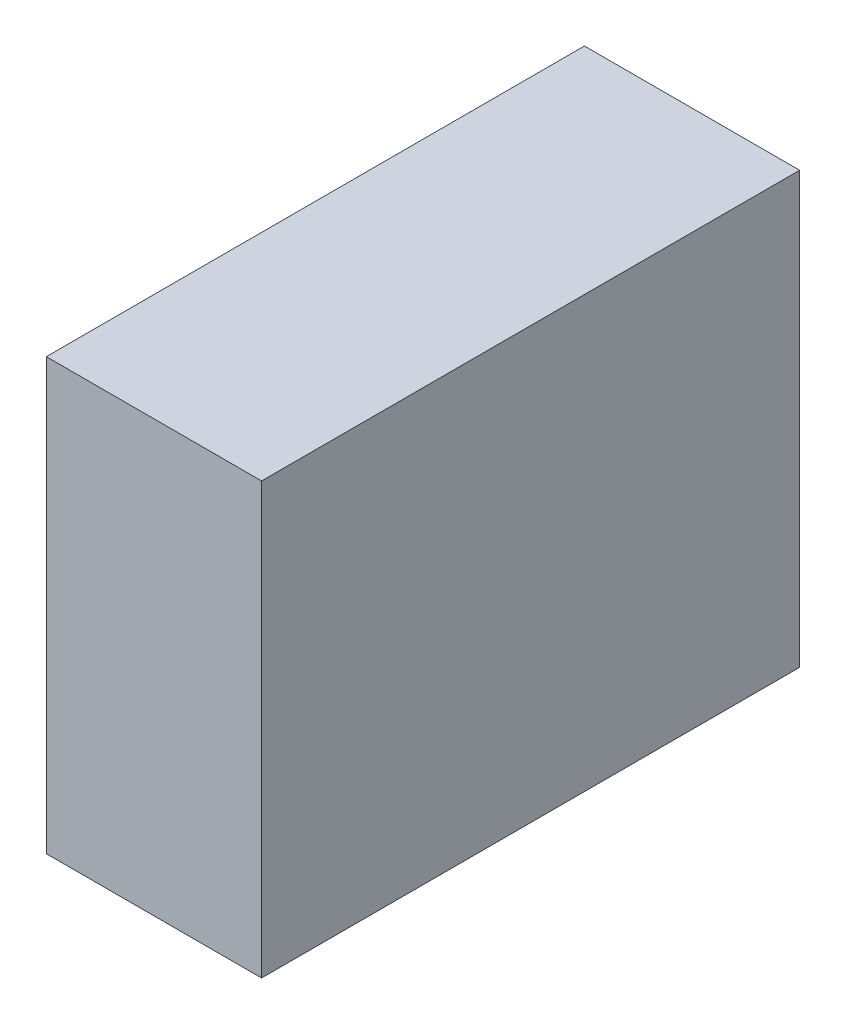
ISO-10303-21;
HEADER;
FILE_DESCRIPTION(('STEP AP214'),'2;1');
FILE_NAME('part.step','',(''),(''),'','','');
FILE_SCHEMA(('AUTOMOTIVE_DESIGN { 1 0 10303 214 1 1 1 1 }'));
ENDSEC;
DATA;
#1=APPLICATION_CONTEXT('core data for automotive mechanical design processes');
#2=APPLICATION_PROTOCOL_DEFINITION('international standard','automotive_design',2000,#1);
#3=PRODUCT_CONTEXT('',#1,'mechanical');
#4=PRODUCT('Part','Part','',(#3));
#5=PRODUCT_RELATED_PRODUCT_CATEGORY('part','',(#4));
#6=PRODUCT_DEFINITION_FORMATION('','',#4);
#7=PRODUCT_DEFINITION_CONTEXT('part definition',#1,'design');
#8=PRODUCT_DEFINITION('design','',#6,#7);
#9=PRODUCT_DEFINITION_SHAPE('','',#8);
#10=(LENGTH_UNIT() NAMED_UNIT(*) SI_UNIT(.MILLI.,.METRE.));
#11=(NAMED_UNIT(*) PLANE_ANGLE_UNIT() SI_UNIT($,.RADIAN.));
#12=(NAMED_UNIT(*) SI_UNIT($,.STERADIAN.) SOLID_ANGLE_UNIT());
#13=UNCERTAINTY_MEASURE_WITH_UNIT(LENGTH_MEASURE(1.E-05),#10,'distance_accuracy_value','');
#14=(GEOMETRIC_REPRESENTATION_CONTEXT(3) GLOBAL_UNCERTAINTY_ASSIGNED_CONTEXT((#13)) GLOBAL_UNIT_ASSIGNED_CONTEXT((#10,
#11,#12)) REPRESENTATION_CONTEXT('',''));
#15=CARTESIAN_POINT('',(0.,0.,0.));
#16=DIRECTION('',(0.,0.,1.));
#17=DIRECTION('',(1.,0.,0.));
#18=AXIS2_PLACEMENT_3D('',#15,#16,#17);
#19=CARTESIAN_POINT('',(0.,0.,50.));
#20=DIRECTION('',(1.,0.,0.));
#21=DIRECTION('',(0.,1.,0.));
#22=AXIS2_PLACEMENT_3D('',#19,#20,#21);
#23=PLANE('',#22);
#24=DIRECTION('',(0.,-1.,0.));
#25=VECTOR('',#24,1.);
#26=CARTESIAN_POINT('',(0.,0.,0.));
#27=LINE('',#26,#25);
#28=CARTESIAN_POINT('',(0.,0.,0.));
#29=VERTEX_POINT('',#28);
#30=CARTESIAN_POINT('',(0.,-40.,0.));
#31=VERTEX_POINT('',#30);
#32=EDGE_CURVE('E94',#29,#31,#27,.T.);
#33=ORIENTED_EDGE('',*,*,#32,.T.);
#34=DIRECTION('',(0.,0.,-1.));
#35=VECTOR('',#34,1.);
#36=CARTESIAN_POINT('',(0.,-40.,50.));
#37=LINE('',#36,#35);
#38=CARTESIAN_POINT('',(0.,-40.,50.));
#39=VERTEX_POINT('',#38);
#40=EDGE_CURVE('E11',#39,#31,#37,.T.);
#41=ORIENTED_EDGE('',*,*,#40,.F.);
#42=DIRECTION('',(0.,-1.,0.));
#43=VECTOR('',#42,1.);
#44=CARTESIAN_POINT('',(0.,0.,50.));
#45=LINE('',#44,#43);
#46=CARTESIAN_POINT('',(0.,0.,50.));
#47=VERTEX_POINT('',#46);
#48=EDGE_CURVE('E82',#47,#39,#45,.T.);
#49=ORIENTED_EDGE('',*,*,#48,.F.);
#50=DIRECTION('',(0.,0.,-1.));
#51=VECTOR('',#50,1.);
#52=CARTESIAN_POINT('',(0.,0.,50.));
#53=LINE('',#52,#51);
#54=EDGE_CURVE('E90',#47,#29,#53,.T.);
#55=ORIENTED_EDGE('',*,*,#54,.T.);
#56=EDGE_LOOP('',(#33,#41,#49,#55));
#57=FACE_BOUND('',#56,.T.);
#58=ADVANCED_FACE('F31',(#57),#23,.F.);
#59=CARTESIAN_POINT('',(0.,-40.,50.));
#60=DIRECTION('',(0.,1.,0.));
#61=DIRECTION('',(0.,0.,1.));
#62=AXIS2_PLACEMENT_3D('',#59,#60,#61);
#63=PLANE('',#62);
#64=DIRECTION('',(1.,0.,0.));
#65=VECTOR('',#64,1.);
#66=CARTESIAN_POINT('',(0.,-40.,0.));
#67=LINE('',#66,#65);
#68=CARTESIAN_POINT('',(20.,-40.,0.));
#69=VERTEX_POINT('',#68);
#70=EDGE_CURVE('E86',#31,#69,#67,.T.);
#71=ORIENTED_EDGE('',*,*,#70,.T.);
#72=DIRECTION('',(0.,0.,-1.));
#73=VECTOR('',#72,1.);
#74=CARTESIAN_POINT('',(20.,-40.,50.));
#75=LINE('',#74,#73);
#76=CARTESIAN_POINT('',(20.,-40.,50.));
#77=VERTEX_POINT('',#76);
#78=EDGE_CURVE('E39',#77,#69,#75,.T.);
#79=ORIENTED_EDGE('',*,*,#78,.F.);
#80=DIRECTION('',(1.,0.,0.));
#81=VECTOR('',#80,1.);
#82=CARTESIAN_POINT('',(0.,-40.,50.));
#83=LINE('',#82,#81);
#84=EDGE_CURVE('E77',#39,#77,#83,.T.);
#85=ORIENTED_EDGE('',*,*,#84,.F.);
#86=ORIENTED_EDGE('',*,*,#40,.T.);
#87=EDGE_LOOP('',(#71,#79,#85,#86));
#88=FACE_BOUND('',#87,.T.);
#89=ADVANCED_FACE('F85',(#88),#63,.F.);
#90=CARTESIAN_POINT('',(20.,0.,50.));
#91=DIRECTION('',(-1.,0.,0.));
#92=DIRECTION('',(0.,-1.,0.));
#93=AXIS2_PLACEMENT_3D('',#90,#91,#92);
#94=PLANE('',#93);
#95=DIRECTION('',(0.,1.,0.));
#96=VECTOR('',#95,1.);
#97=CARTESIAN_POINT('',(20.,0.,0.));
#98=LINE('',#97,#96);
#99=CARTESIAN_POINT('',(20.,0.,0.));
#100=VERTEX_POINT('',#99);
#101=EDGE_CURVE('E64',#69,#100,#98,.T.);
#102=ORIENTED_EDGE('',*,*,#101,.T.);
#103=DIRECTION('',(0.,0.,-1.));
#104=VECTOR('',#103,1.);
#105=CARTESIAN_POINT('',(20.,0.,50.));
#106=LINE('',#105,#104);
#107=CARTESIAN_POINT('',(20.,0.,50.));
#108=VERTEX_POINT('',#107);
#109=EDGE_CURVE('E87',#108,#100,#106,.T.);
#110=ORIENTED_EDGE('',*,*,#109,.F.);
#111=DIRECTION('',(0.,1.,0.));
#112=VECTOR('',#111,1.);
#113=CARTESIAN_POINT('',(20.,0.,50.));
#114=LINE('',#113,#112);
#115=EDGE_CURVE('E80',#77,#108,#114,.T.);
#116=ORIENTED_EDGE('',*,*,#115,.F.);
#117=ORIENTED_EDGE('',*,*,#78,.T.);
#118=EDGE_LOOP('',(#102,#110,#116,#117));
#119=FACE_BOUND('',#118,.T.);
#120=ADVANCED_FACE('F88',(#119),#94,.F.);
#121=CARTESIAN_POINT('',(0.,0.,50.));
#122=DIRECTION('',(0.,-1.,0.));
#123=DIRECTION('',(0.,0.,-1.));
#124=AXIS2_PLACEMENT_3D('',#121,#122,#123);
#125=PLANE('',#124);
#126=DIRECTION('',(-1.,0.,0.));
#127=VECTOR('',#126,1.);
#128=CARTESIAN_POINT('',(0.,0.,0.));
#129=LINE('',#128,#127);
#130=EDGE_CURVE('E70',#100,#29,#129,.T.);
#131=ORIENTED_EDGE('',*,*,#130,.T.);
#132=ORIENTED_EDGE('',*,*,#54,.F.);
#133=DIRECTION('',(-1.,0.,0.));
#134=VECTOR('',#133,1.);
#135=CARTESIAN_POINT('',(0.,0.,50.));
#136=LINE('',#135,#134);
#137=EDGE_CURVE('E47',#108,#47,#136,.T.);
#138=ORIENTED_EDGE('',*,*,#137,.F.);
#139=ORIENTED_EDGE('',*,*,#109,.T.);
#140=EDGE_LOOP('',(#131,#132,#138,#139));
#141=FACE_BOUND('',#140,.T.);
#142=ADVANCED_FACE('F101',(#141),#125,.F.);
#143=CARTESIAN_POINT('',(0.,-40.,50.));
#144=DIRECTION('',(0.,0.,1.));
#145=DIRECTION('',(1.,0.,0.));
#146=AXIS2_PLACEMENT_3D('',#143,#144,#145);
#147=PLANE('',#146);
#148=ORIENTED_EDGE('',*,*,#48,.T.);
#149=ORIENTED_EDGE('',*,*,#84,.T.);
#150=ORIENTED_EDGE('',*,*,#115,.T.);
#151=ORIENTED_EDGE('',*,*,#137,.T.);
#152=EDGE_LOOP('',(#148,#149,#150,#151));
#153=FACE_BOUND('',#152,.T.);
#154=ADVANCED_FACE('F78',(#153),#147,.T.);
#155=CARTESIAN_POINT('',(0.,-40.,0.));
#156=DIRECTION('',(0.,0.,1.));
#157=DIRECTION('',(1.,0.,0.));
#158=AXIS2_PLACEMENT_3D('',#155,#156,#157);
#159=PLANE('',#158);
#160=ORIENTED_EDGE('',*,*,#32,.F.);
#161=ORIENTED_EDGE('',*,*,#130,.F.);
#162=ORIENTED_EDGE('',*,*,#101,.F.);
#163=ORIENTED_EDGE('',*,*,#70,.F.);
#164=EDGE_LOOP('',(#160,#161,#162,#163));
#165=FACE_BOUND('',#164,.T.);
#166=ADVANCED_FACE('F104',(#165),#159,.F.);
#167=CLOSED_SHELL('',(#58,#89,#120,#142,#154,#166));
#168=MANIFOLD_SOLID_BREP('B2',#167);
#169=ADVANCED_BREP_SHAPE_REPRESENTATION('',(#18,#168),#14);
#170=SHAPE_DEFINITION_REPRESENTATION(#9,#169);
ENDSEC;
END-ISO-10303-21;
